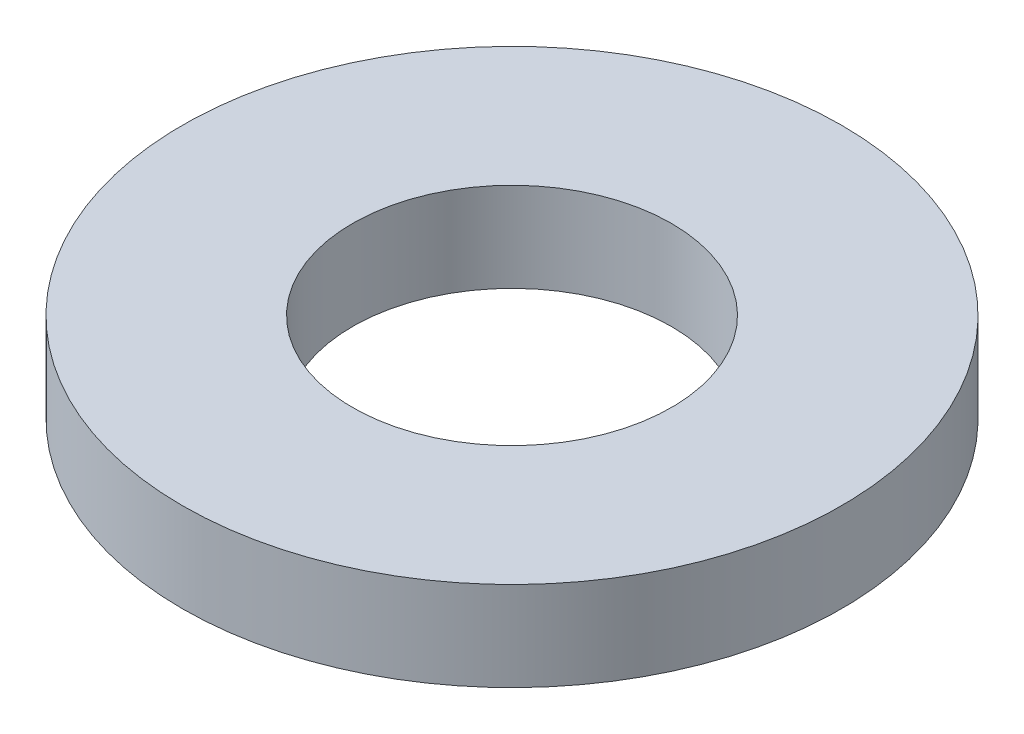
ISO-10303-21;
HEADER;
FILE_DESCRIPTION(('STEP AP214'),'2;1');
FILE_NAME('part.step','',(''),(''),'','','');
FILE_SCHEMA(('AUTOMOTIVE_DESIGN { 1 0 10303 214 1 1 1 1 }'));
ENDSEC;
DATA;
#1=APPLICATION_CONTEXT('core data for automotive mechanical design processes');
#2=APPLICATION_PROTOCOL_DEFINITION('international standard','automotive_design',2000,#1);
#3=PRODUCT_CONTEXT('',#1,'mechanical');
#4=PRODUCT('Part','Part','',(#3));
#5=PRODUCT_RELATED_PRODUCT_CATEGORY('part','',(#4));
#6=PRODUCT_DEFINITION_FORMATION('','',#4);
#7=PRODUCT_DEFINITION_CONTEXT('part definition',#1,'design');
#8=PRODUCT_DEFINITION('design','',#6,#7);
#9=PRODUCT_DEFINITION_SHAPE('','',#8);
#10=(LENGTH_UNIT() NAMED_UNIT(*) SI_UNIT(.MILLI.,.METRE.));
#11=(NAMED_UNIT(*) PLANE_ANGLE_UNIT() SI_UNIT($,.RADIAN.));
#12=(NAMED_UNIT(*) SI_UNIT($,.STERADIAN.) SOLID_ANGLE_UNIT());
#13=UNCERTAINTY_MEASURE_WITH_UNIT(LENGTH_MEASURE(1.E-05),#10,'distance_accuracy_value','');
#14=(GEOMETRIC_REPRESENTATION_CONTEXT(3) GLOBAL_UNCERTAINTY_ASSIGNED_CONTEXT((#13)) GLOBAL_UNIT_ASSIGNED_CONTEXT((#10,
#11,#12)) REPRESENTATION_CONTEXT('',''));
#15=CARTESIAN_POINT('',(0.,0.,0.));
#16=DIRECTION('',(0.,0.,1.));
#17=DIRECTION('',(1.,0.,0.));
#18=AXIS2_PLACEMENT_3D('',#15,#16,#17);
#19=CARTESIAN_POINT('',(0.,21.,0.));
#20=DIRECTION('',(0.,-1.,0.));
#21=DIRECTION('',(0.,0.,-1.));
#22=AXIS2_PLACEMENT_3D('',#19,#20,#21);
#23=CYLINDRICAL_SURFACE('',#22,77.5);
#24=CARTESIAN_POINT('',(0.,21.,0.));
#25=DIRECTION('',(0.,1.,0.));
#26=DIRECTION('',(0.,0.,1.));
#27=AXIS2_PLACEMENT_3D('',#24,#25,#26);
#28=CIRCLE('',#27,77.5);
#29=CARTESIAN_POINT('',(0.,21.,-77.5));
#30=VERTEX_POINT('',#29);
#31=EDGE_CURVE('E10',#30,#30,#28,.T.);
#32=CARTESIAN_POINT('',(0.,0.,0.));
#33=DIRECTION('',(0.,1.,0.));
#34=DIRECTION('',(0.,0.,1.));
#35=AXIS2_PLACEMENT_3D('',#32,#33,#34);
#36=CIRCLE('',#35,77.5);
#37=CARTESIAN_POINT('',(0.,0.,-77.5));
#38=VERTEX_POINT('',#37);
#39=EDGE_CURVE('E37',#38,#38,#36,.T.);
#40=CARTESIAN_POINT('',(0.,21.,-77.5));
#41=CARTESIAN_POINT('',(0.,20.78125,-77.5));
#42=CARTESIAN_POINT('',(0.,20.5625,-77.5));
#43=CARTESIAN_POINT('',(0.,20.125,-77.5));
#44=CARTESIAN_POINT('',(0.,19.90625,-77.5));
#45=CARTESIAN_POINT('',(0.,19.46875,-77.5));
#46=CARTESIAN_POINT('',(0.,19.25,-77.5));
#47=CARTESIAN_POINT('',(0.,18.8125,-77.5));
#48=CARTESIAN_POINT('',(0.,18.59375,-77.5));
#49=CARTESIAN_POINT('',(0.,18.15625,-77.5));
#50=CARTESIAN_POINT('',(0.,17.9375,-77.5));
#51=CARTESIAN_POINT('',(0.,17.5,-77.5));
#52=CARTESIAN_POINT('',(0.,17.28125,-77.5));
#53=CARTESIAN_POINT('',(0.,16.84375,-77.5));
#54=CARTESIAN_POINT('',(0.,16.625,-77.5));
#55=CARTESIAN_POINT('',(0.,16.1875,-77.5));
#56=CARTESIAN_POINT('',(0.,15.96875,-77.5));
#57=CARTESIAN_POINT('',(0.,15.53125,-77.5));
#58=CARTESIAN_POINT('',(0.,15.3125,-77.5));
#59=CARTESIAN_POINT('',(0.,14.875,-77.5));
#60=CARTESIAN_POINT('',(0.,14.65625,-77.5));
#61=CARTESIAN_POINT('',(0.,14.21875,-77.5));
#62=CARTESIAN_POINT('',(0.,14.,-77.5));
#63=CARTESIAN_POINT('',(0.,13.5625,-77.5));
#64=CARTESIAN_POINT('',(0.,13.34375,-77.5));
#65=CARTESIAN_POINT('',(0.,12.90625,-77.5));
#66=CARTESIAN_POINT('',(0.,12.6875,-77.5));
#67=CARTESIAN_POINT('',(0.,12.25,-77.5));
#68=CARTESIAN_POINT('',(0.,12.03125,-77.5));
#69=CARTESIAN_POINT('',(0.,11.59375,-77.5));
#70=CARTESIAN_POINT('',(0.,11.375,-77.5));
#71=CARTESIAN_POINT('',(0.,10.9375,-77.5));
#72=CARTESIAN_POINT('',(0.,10.71875,-77.5));
#73=CARTESIAN_POINT('',(0.,10.28125,-77.5));
#74=CARTESIAN_POINT('',(0.,10.0625,-77.5));
#75=CARTESIAN_POINT('',(0.,9.625,-77.5));
#76=CARTESIAN_POINT('',(0.,9.40625,-77.5));
#77=CARTESIAN_POINT('',(0.,8.96875,-77.5));
#78=CARTESIAN_POINT('',(0.,8.75,-77.5));
#79=CARTESIAN_POINT('',(0.,8.3125,-77.5));
#80=CARTESIAN_POINT('',(0.,8.09375,-77.5));
#81=CARTESIAN_POINT('',(0.,7.65625,-77.5));
#82=CARTESIAN_POINT('',(0.,7.4375,-77.5));
#83=CARTESIAN_POINT('',(0.,7.,-77.5));
#84=CARTESIAN_POINT('',(0.,6.78125,-77.5));
#85=CARTESIAN_POINT('',(0.,6.34375,-77.5));
#86=CARTESIAN_POINT('',(0.,6.125,-77.5));
#87=CARTESIAN_POINT('',(0.,5.6875,-77.5));
#88=CARTESIAN_POINT('',(0.,5.46875,-77.5));
#89=CARTESIAN_POINT('',(0.,5.03125,-77.5));
#90=CARTESIAN_POINT('',(0.,4.8125,-77.5));
#91=CARTESIAN_POINT('',(0.,4.375,-77.5));
#92=CARTESIAN_POINT('',(0.,4.15625,-77.5));
#93=CARTESIAN_POINT('',(0.,3.71875,-77.5));
#94=CARTESIAN_POINT('',(0.,3.5,-77.5));
#95=CARTESIAN_POINT('',(0.,3.0625,-77.5));
#96=CARTESIAN_POINT('',(0.,2.84375,-77.5));
#97=CARTESIAN_POINT('',(0.,2.40625,-77.5));
#98=CARTESIAN_POINT('',(0.,2.1875,-77.5));
#99=CARTESIAN_POINT('',(0.,1.75,-77.5));
#100=CARTESIAN_POINT('',(0.,1.53125,-77.5));
#101=CARTESIAN_POINT('',(0.,1.09375,-77.5));
#102=CARTESIAN_POINT('',(0.,0.875000000000001,-77.5));
#103=CARTESIAN_POINT('',(0.,0.4375,-77.5));
#104=CARTESIAN_POINT('',(0.,0.21875,-77.5));
#105=CARTESIAN_POINT('',(0.,0.,-77.5));
#106=B_SPLINE_CURVE_WITH_KNOTS('',3,(#40,#41,#42,#43,#44,#45,#46,#47,#48,#49,#50,#51,#52,#53,
#54,#55,#56,#57,#58,#59,#60,#61,#62,#63,#64,#65,#66,#67,#68,#69,#70,#71,#72,#73,#74,#75,#76,#77,
#78,#79,#80,#81,#82,#83,#84,#85,#86,#87,#88,#89,#90,#91,#92,#93,#94,#95,#96,#97,#98,#99,#100,
#101,#102,#103,#104,#105),.UNSPECIFIED.,.F.,.F.,(4,2,2,2,2,2,2,2,2,2,2,2,2,2,2,2,2,2,2,2,2,2,2,
2,2,2,2,2,2,2,2,2,4),(0.,0.656249999999997,1.3125,1.96875,2.625,3.28125,3.9375,4.59375,5.25,
5.90625,6.5625,7.21875,7.875,8.53125,9.1875,9.84375,10.5,11.15625,11.8125,12.46875,13.125,
13.78125,14.4375,15.09375,15.75,16.40625,17.0625,17.71875,18.375,19.03125,19.6875,20.34375,21.),.UNSPECIFIED.);
#107=EDGE_CURVE('BSEAM40',#30,#38,#106,.T.);
#108=ORIENTED_EDGE('',*,*,#31,.F.);
#109=ORIENTED_EDGE('',*,*,#39,.T.);
#110=ORIENTED_EDGE('',*,*,#107,.T.);
#111=ORIENTED_EDGE('',*,*,#107,.F.);
#112=EDGE_LOOP('',(#108,#110,#109,#111));
#113=FACE_BOUND('',#112,.T.);
#114=ADVANCED_FACE('F40',(#113),#23,.T.);
#115=CARTESIAN_POINT('',(0.,21.,0.));
#116=DIRECTION('',(0.,1.,0.));
#117=DIRECTION('',(0.,0.,1.));
#118=AXIS2_PLACEMENT_3D('',#115,#116,#117);
#119=PLANE('',#118);
#120=CARTESIAN_POINT('',(0.,21.,0.));
#121=DIRECTION('',(0.,1.,0.));
#122=DIRECTION('',(0.,0.,1.));
#123=AXIS2_PLACEMENT_3D('',#120,#121,#122);
#124=CIRCLE('',#123,37.5);
#125=CARTESIAN_POINT('',(0.,21.,-37.5));
#126=VERTEX_POINT('',#125);
#127=EDGE_CURVE('E50',#126,#126,#124,.T.);
#128=ORIENTED_EDGE('',*,*,#127,.F.);
#129=EDGE_LOOP('',(#128));
#130=FACE_BOUND('',#129,.T.);
#131=ORIENTED_EDGE('',*,*,#31,.T.);
#132=EDGE_LOOP('',(#131));
#133=FACE_BOUND('',#132,.T.);
#134=ADVANCED_FACE('F59',(#130,#133),#119,.T.);
#135=CARTESIAN_POINT('',(0.,0.,0.));
#136=DIRECTION('',(0.,1.,0.));
#137=DIRECTION('',(0.,0.,1.));
#138=AXIS2_PLACEMENT_3D('',#135,#136,#137);
#139=PLANE('',#138);
#140=CARTESIAN_POINT('',(0.,0.,0.));
#141=DIRECTION('',(0.,1.,0.));
#142=DIRECTION('',(0.,0.,1.));
#143=AXIS2_PLACEMENT_3D('',#140,#141,#142);
#144=CIRCLE('',#143,37.5);
#145=CARTESIAN_POINT('',(0.,0.,-37.5));
#146=VERTEX_POINT('',#145);
#147=EDGE_CURVE('E47',#146,#146,#144,.T.);
#148=ORIENTED_EDGE('',*,*,#147,.T.);
#149=EDGE_LOOP('',(#148));
#150=FACE_BOUND('',#149,.T.);
#151=ORIENTED_EDGE('',*,*,#39,.F.);
#152=EDGE_LOOP('',(#151));
#153=FACE_BOUND('',#152,.T.);
#154=ADVANCED_FACE('F58',(#150,#153),#139,.F.);
#155=CARTESIAN_POINT('',(0.,21.,0.));
#156=DIRECTION('',(0.,-1.,0.));
#157=DIRECTION('',(0.,0.,-1.));
#158=AXIS2_PLACEMENT_3D('',#155,#156,#157);
#159=CYLINDRICAL_SURFACE('',#158,37.5);
#160=CARTESIAN_POINT('',(0.,21.,-37.5));
#161=CARTESIAN_POINT('',(0.,20.78125,-37.5));
#162=CARTESIAN_POINT('',(0.,20.5625,-37.5));
#163=CARTESIAN_POINT('',(0.,20.125,-37.5));
#164=CARTESIAN_POINT('',(0.,19.90625,-37.5));
#165=CARTESIAN_POINT('',(0.,19.46875,-37.5));
#166=CARTESIAN_POINT('',(0.,19.25,-37.5));
#167=CARTESIAN_POINT('',(0.,18.8125,-37.5));
#168=CARTESIAN_POINT('',(0.,18.59375,-37.5));
#169=CARTESIAN_POINT('',(0.,18.15625,-37.5));
#170=CARTESIAN_POINT('',(0.,17.9375,-37.5));
#171=CARTESIAN_POINT('',(0.,17.5,-37.5));
#172=CARTESIAN_POINT('',(0.,17.28125,-37.5));
#173=CARTESIAN_POINT('',(0.,16.84375,-37.5));
#174=CARTESIAN_POINT('',(0.,16.625,-37.5));
#175=CARTESIAN_POINT('',(0.,16.1875,-37.5));
#176=CARTESIAN_POINT('',(0.,15.96875,-37.5));
#177=CARTESIAN_POINT('',(0.,15.53125,-37.5));
#178=CARTESIAN_POINT('',(0.,15.3125,-37.5));
#179=CARTESIAN_POINT('',(0.,14.875,-37.5));
#180=CARTESIAN_POINT('',(0.,14.65625,-37.5));
#181=CARTESIAN_POINT('',(0.,14.21875,-37.5));
#182=CARTESIAN_POINT('',(0.,14.,-37.5));
#183=CARTESIAN_POINT('',(0.,13.5625,-37.5));
#184=CARTESIAN_POINT('',(0.,13.34375,-37.5));
#185=CARTESIAN_POINT('',(0.,12.90625,-37.5));
#186=CARTESIAN_POINT('',(0.,12.6875,-37.5));
#187=CARTESIAN_POINT('',(0.,12.25,-37.5));
#188=CARTESIAN_POINT('',(0.,12.03125,-37.5));
#189=CARTESIAN_POINT('',(0.,11.59375,-37.5));
#190=CARTESIAN_POINT('',(0.,11.375,-37.5));
#191=CARTESIAN_POINT('',(0.,10.9375,-37.5));
#192=CARTESIAN_POINT('',(0.,10.71875,-37.5));
#193=CARTESIAN_POINT('',(0.,10.28125,-37.5));
#194=CARTESIAN_POINT('',(0.,10.0625,-37.5));
#195=CARTESIAN_POINT('',(0.,9.625,-37.5));
#196=CARTESIAN_POINT('',(0.,9.40625,-37.5));
#197=CARTESIAN_POINT('',(0.,8.96875,-37.5));
#198=CARTESIAN_POINT('',(0.,8.75,-37.5));
#199=CARTESIAN_POINT('',(0.,8.3125,-37.5));
#200=CARTESIAN_POINT('',(0.,8.09375,-37.5));
#201=CARTESIAN_POINT('',(0.,7.65625,-37.5));
#202=CARTESIAN_POINT('',(0.,7.4375,-37.5));
#203=CARTESIAN_POINT('',(0.,7.,-37.5));
#204=CARTESIAN_POINT('',(0.,6.78125,-37.5));
#205=CARTESIAN_POINT('',(0.,6.34375,-37.5));
#206=CARTESIAN_POINT('',(0.,6.125,-37.5));
#207=CARTESIAN_POINT('',(0.,5.6875,-37.5));
#208=CARTESIAN_POINT('',(0.,5.46875,-37.5));
#209=CARTESIAN_POINT('',(0.,5.03125,-37.5));
#210=CARTESIAN_POINT('',(0.,4.8125,-37.5));
#211=CARTESIAN_POINT('',(0.,4.375,-37.5));
#212=CARTESIAN_POINT('',(0.,4.15625,-37.5));
#213=CARTESIAN_POINT('',(0.,3.71875,-37.5));
#214=CARTESIAN_POINT('',(0.,3.5,-37.5));
#215=CARTESIAN_POINT('',(0.,3.0625,-37.5));
#216=CARTESIAN_POINT('',(0.,2.84375,-37.5));
#217=CARTESIAN_POINT('',(0.,2.40625,-37.5));
#218=CARTESIAN_POINT('',(0.,2.1875,-37.5));
#219=CARTESIAN_POINT('',(0.,1.75,-37.5));
#220=CARTESIAN_POINT('',(0.,1.53125,-37.5));
#221=CARTESIAN_POINT('',(0.,1.09375,-37.5));
#222=CARTESIAN_POINT('',(0.,0.875000000000001,-37.5));
#223=CARTESIAN_POINT('',(0.,0.4375,-37.5));
#224=CARTESIAN_POINT('',(0.,0.21875,-37.5));
#225=CARTESIAN_POINT('',(0.,0.,-37.5));
#226=B_SPLINE_CURVE_WITH_KNOTS('',3,(#160,#161,#162,#163,#164,#165,#166,#167,#168,#169,#170,
#171,#172,#173,#174,#175,#176,#177,#178,#179,#180,#181,#182,#183,#184,#185,#186,#187,#188,#189,
#190,#191,#192,#193,#194,#195,#196,#197,#198,#199,#200,#201,#202,#203,#204,#205,#206,#207,#208,
#209,#210,#211,#212,#213,#214,#215,#216,#217,#218,#219,#220,#221,#222,#223,#224,#225),
.UNSPECIFIED.,.F.,.F.,(4,2,2,2,2,2,2,2,2,2,2,2,2,2,2,2,2,2,2,2,2,2,2,2,2,2,2,2,2,2,2,2,4),(0.,
0.656249999999997,1.3125,1.96875,2.625,3.28125,3.9375,4.59375,5.25,5.90625,6.5625,7.21875,7.875,
8.53125,9.1875,9.84375,10.5,11.15625,11.8125,12.46875,13.125,13.78125,14.4375,15.09375,15.75,
16.40625,17.0625,17.71875,18.375,19.03125,19.6875,20.34375,21.),.UNSPECIFIED.);
#227=EDGE_CURVE('BSEAM54',#126,#146,#226,.T.);
#228=ORIENTED_EDGE('',*,*,#127,.T.);
#229=ORIENTED_EDGE('',*,*,#147,.F.);
#230=ORIENTED_EDGE('',*,*,#227,.T.);
#231=ORIENTED_EDGE('',*,*,#227,.F.);
#232=EDGE_LOOP('',(#228,#230,#229,#231));
#233=FACE_BOUND('',#232,.T.);
#234=ADVANCED_FACE('F54',(#233),#159,.F.);
#235=CLOSED_SHELL('',(#114,#134,#154,#234));
#236=MANIFOLD_SOLID_BREP('B2',#235);
#237=ADVANCED_BREP_SHAPE_REPRESENTATION('',(#18,#236),#14);
#238=SHAPE_DEFINITION_REPRESENTATION(#9,#237);
ENDSEC;
END-ISO-10303-21;
